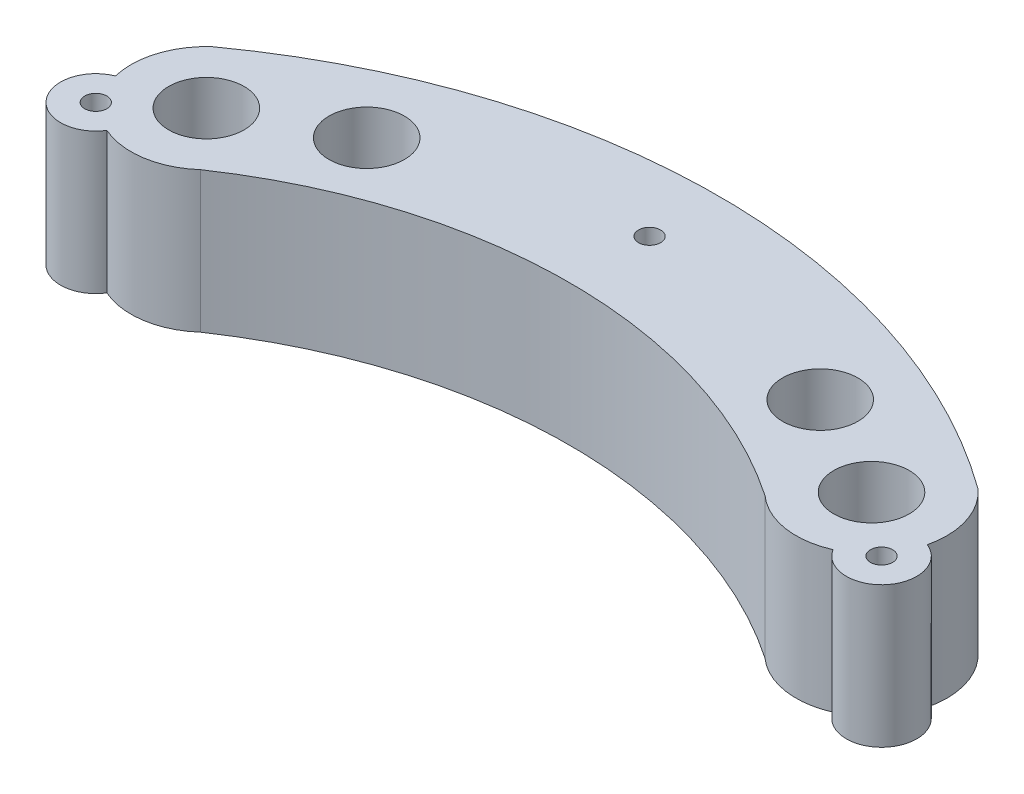
ISO-10303-21;
HEADER;
FILE_DESCRIPTION(('STEP AP214'),'2;1');
FILE_NAME('part.step','',(''),(''),'','','');
FILE_SCHEMA(('AUTOMOTIVE_DESIGN { 1 0 10303 214 1 1 1 1 }'));
ENDSEC;
DATA;
#1=APPLICATION_CONTEXT('core data for automotive mechanical design processes');
#2=APPLICATION_PROTOCOL_DEFINITION('international standard','automotive_design',2000,#1);
#3=PRODUCT_CONTEXT('',#1,'mechanical');
#4=PRODUCT('Part','Part','',(#3));
#5=PRODUCT_RELATED_PRODUCT_CATEGORY('part','',(#4));
#6=PRODUCT_DEFINITION_FORMATION('','',#4);
#7=PRODUCT_DEFINITION_CONTEXT('part definition',#1,'design');
#8=PRODUCT_DEFINITION('design','',#6,#7);
#9=PRODUCT_DEFINITION_SHAPE('','',#8);
#10=(LENGTH_UNIT() NAMED_UNIT(*) SI_UNIT(.MILLI.,.METRE.));
#11=(NAMED_UNIT(*) PLANE_ANGLE_UNIT() SI_UNIT($,.RADIAN.));
#12=(NAMED_UNIT(*) SI_UNIT($,.STERADIAN.) SOLID_ANGLE_UNIT());
#13=UNCERTAINTY_MEASURE_WITH_UNIT(LENGTH_MEASURE(1.E-05),#10,'distance_accuracy_value','');
#14=(GEOMETRIC_REPRESENTATION_CONTEXT(3) GLOBAL_UNCERTAINTY_ASSIGNED_CONTEXT((#13)) GLOBAL_UNIT_ASSIGNED_CONTEXT((#10,
#11,#12)) REPRESENTATION_CONTEXT('',''));
#15=CARTESIAN_POINT('',(0.,0.,0.));
#16=DIRECTION('',(0.,0.,1.));
#17=DIRECTION('',(1.,0.,0.));
#18=AXIS2_PLACEMENT_3D('',#15,#16,#17);
#19=CARTESIAN_POINT('',(84.0143896078789,-3.175,0.));
#20=DIRECTION('',(0.,1.,0.));
#21=DIRECTION('',(0.,0.,1.));
#22=AXIS2_PLACEMENT_3D('',#19,#20,#21);
#23=CYLINDRICAL_SURFACE('',#22,9.52500000000001);
#24=DIRECTION('',(0.,1.,0.));
#25=VECTOR('',#24,1.);
#26=CARTESIAN_POINT('',(93.2771410737958,5.715,2.21969824089963));
#27=LINE('',#26,#25);
#28=CARTESIAN_POINT('',(93.2771410737958,-3.175,2.21969824089963));
#29=VERTEX_POINT('',#28);
#30=CARTESIAN_POINT('',(93.2771410737958,14.605,2.21969824089963));
#31=VERTEX_POINT('',#30);
#32=EDGE_CURVE('E102',#29,#31,#27,.T.);
#33=ORIENTED_EDGE('',*,*,#32,.F.);
#34=CARTESIAN_POINT('',(84.0143896078789,-3.175,0.));
#35=DIRECTION('',(0.,1.,0.));
#36=DIRECTION('',(0.,0.,1.));
#37=AXIS2_PLACEMENT_3D('',#34,#35,#36);
#38=CIRCLE('',#37,9.52500000000001);
#39=CARTESIAN_POINT('',(90.364389607879,-3.175,-7.09951582856176));
#40=VERTEX_POINT('',#39);
#41=EDGE_CURVE('E112',#29,#40,#38,.T.);
#42=ORIENTED_EDGE('',*,*,#41,.T.);
#43=DIRECTION('',(0.,1.,0.));
#44=VECTOR('',#43,1.);
#45=CARTESIAN_POINT('',(90.364389607879,-3.175,-7.09951582856176));
#46=LINE('',#45,#44);
#47=CARTESIAN_POINT('',(90.364389607879,14.605,-7.09951582856176));
#48=VERTEX_POINT('',#47);
#49=EDGE_CURVE('E11',#40,#48,#46,.T.);
#50=ORIENTED_EDGE('',*,*,#49,.T.);
#51=CARTESIAN_POINT('',(84.0143896078789,14.605,0.));
#52=DIRECTION('',(0.,1.,0.));
#53=DIRECTION('',(0.,0.,1.));
#54=AXIS2_PLACEMENT_3D('',#51,#52,#53);
#55=CIRCLE('',#54,9.52500000000001);
#56=EDGE_CURVE('E114',#31,#48,#55,.T.);
#57=ORIENTED_EDGE('',*,*,#56,.F.);
#58=EDGE_LOOP('',(#33,#42,#50,#57));
#59=FACE_BOUND('',#58,.T.);
#60=ADVANCED_FACE('F34',(#59),#23,.T.);
#61=CARTESIAN_POINT('',(0.,-3.175,0.));
#62=DIRECTION('',(0.,1.,0.));
#63=DIRECTION('',(0.,0.,1.));
#64=AXIS2_PLACEMENT_3D('',#61,#62,#63);
#65=CYLINDRICAL_SURFACE('',#64,9.525);
#66=DIRECTION('',(0.,1.,0.));
#67=VECTOR('',#66,1.);
#68=CARTESIAN_POINT('',(-3.85364197670597,5.715,8.71062962795283));
#69=LINE('',#68,#67);
#70=CARTESIAN_POINT('',(-3.85364197670597,-3.175,8.71062962795283));
#71=VERTEX_POINT('',#70);
#72=CARTESIAN_POINT('',(-3.85364197670597,14.605,8.71062962795283));
#73=VERTEX_POINT('',#72);
#74=EDGE_CURVE('E194',#71,#73,#69,.T.);
#75=ORIENTED_EDGE('',*,*,#74,.F.);
#76=CARTESIAN_POINT('',(0.,-3.175,0.));
#77=DIRECTION('',(0.,1.,0.));
#78=DIRECTION('',(0.,0.,1.));
#79=AXIS2_PLACEMENT_3D('',#76,#77,#78);
#80=CIRCLE('',#79,9.525);
#81=CARTESIAN_POINT('',(6.35,-3.175,7.09951582856184));
#82=VERTEX_POINT('',#81);
#83=EDGE_CURVE('E183',#71,#82,#80,.T.);
#84=ORIENTED_EDGE('',*,*,#83,.T.);
#85=DIRECTION('',(0.,1.,0.));
#86=VECTOR('',#85,1.);
#87=CARTESIAN_POINT('',(6.35,-3.175,7.09951582856184));
#88=LINE('',#87,#86);
#89=CARTESIAN_POINT('',(6.35,14.605,7.09951582856184));
#90=VERTEX_POINT('',#89);
#91=EDGE_CURVE('E131',#82,#90,#88,.T.);
#92=ORIENTED_EDGE('',*,*,#91,.T.);
#93=CARTESIAN_POINT('',(0.,14.605,0.));
#94=DIRECTION('',(0.,1.,0.));
#95=DIRECTION('',(0.,0.,1.));
#96=AXIS2_PLACEMENT_3D('',#93,#94,#95);
#97=CIRCLE('',#96,9.525);
#98=EDGE_CURVE('E175',#73,#90,#97,.T.);
#99=ORIENTED_EDGE('',*,*,#98,.F.);
#100=EDGE_LOOP('',(#75,#84,#92,#99));
#101=FACE_BOUND('',#100,.T.);
#102=ADVANCED_FACE('F191',(#101),#65,.T.);
#103=CARTESIAN_POINT('',(42.0071948039394,-3.175,59.8040282531522));
#104=DIRECTION('',(0.,1.,0.));
#105=DIRECTION('',(0.,0.,1.));
#106=AXIS2_PLACEMENT_3D('',#103,#104,#105);
#107=CYLINDRICAL_SURFACE('',#106,82.55);
#108=DIRECTION('',(0.,1.,0.));
#109=VECTOR('',#108,1.);
#110=CARTESIAN_POINT('',(-6.35000000000005,-3.175,-7.09951582856179));
#111=LINE('',#110,#109);
#112=CARTESIAN_POINT('',(-6.35000000000005,-3.175,-7.09951582856179));
#113=VERTEX_POINT('',#112);
#114=CARTESIAN_POINT('',(-6.35000000000005,14.605,-7.09951582856179));
#115=VERTEX_POINT('',#114);
#116=EDGE_CURVE('E124',#113,#115,#111,.T.);
#117=ORIENTED_EDGE('',*,*,#116,.T.);
#118=CARTESIAN_POINT('',(42.0071948039394,14.605,59.8040282531522));
#119=DIRECTION('',(0.,1.,0.));
#120=DIRECTION('',(0.,0.,1.));
#121=AXIS2_PLACEMENT_3D('',#118,#119,#120);
#122=CIRCLE('',#121,82.55);
#123=EDGE_CURVE('E148',#115,#48,#122,.F.);
#124=ORIENTED_EDGE('',*,*,#123,.T.);
#125=ORIENTED_EDGE('',*,*,#49,.F.);
#126=CARTESIAN_POINT('',(42.0071948039394,-3.175,59.8040282531522));
#127=DIRECTION('',(0.,1.,0.));
#128=DIRECTION('',(0.,0.,1.));
#129=AXIS2_PLACEMENT_3D('',#126,#127,#128);
#130=CIRCLE('',#129,82.55);
#131=EDGE_CURVE('E119',#113,#40,#130,.F.);
#132=ORIENTED_EDGE('',*,*,#131,.F.);
#133=EDGE_LOOP('',(#117,#124,#125,#132));
#134=FACE_BOUND('',#133,.T.);
#135=ADVANCED_FACE('F36',(#134),#107,.T.);
#136=DIRECTION('',(0.,1.,0.));
#137=VECTOR('',#136,1.);
#138=CARTESIAN_POINT('',(87.8680315845849,5.715,8.71062962795284));
#139=LINE('',#138,#137);
#140=CARTESIAN_POINT('',(87.8680315845849,14.605,8.71062962795284));
#141=VERTEX_POINT('',#140);
#142=CARTESIAN_POINT('',(87.8680315845849,-3.175,8.71062962795284));
#143=VERTEX_POINT('',#142);
#144=EDGE_CURVE('E105',#141,#143,#139,.F.);
#145=ORIENTED_EDGE('',*,*,#144,.F.);
#146=CARTESIAN_POINT('',(77.6643896078788,14.605,7.09951582856182));
#147=VERTEX_POINT('',#146);
#148=EDGE_CURVE('E181',#147,#141,#55,.T.);
#149=ORIENTED_EDGE('',*,*,#148,.F.);
#150=DIRECTION('',(0.,1.,0.));
#151=VECTOR('',#150,1.);
#152=CARTESIAN_POINT('',(77.6643896078788,-3.175,7.09951582856182));
#153=LINE('',#152,#151);
#154=CARTESIAN_POINT('',(77.6643896078788,-3.175,7.09951582856182));
#155=VERTEX_POINT('',#154);
#156=EDGE_CURVE('E43',#155,#147,#153,.T.);
#157=ORIENTED_EDGE('',*,*,#156,.F.);
#158=EDGE_CURVE('E121',#155,#143,#38,.T.);
#159=ORIENTED_EDGE('',*,*,#158,.T.);
#160=EDGE_LOOP('',(#145,#149,#157,#159));
#161=FACE_BOUND('',#160,.T.);
#162=ADVANCED_FACE('F200',(#161),#23,.T.);
#163=CARTESIAN_POINT('',(42.0071948039394,-3.175,59.642968881382));
#164=DIRECTION('',(0.,1.,0.));
#165=DIRECTION('',(0.,0.,1.));
#166=AXIS2_PLACEMENT_3D('',#163,#164,#165);
#167=CYLINDRICAL_SURFACE('',#166,63.5);
#168=ORIENTED_EDGE('',*,*,#156,.T.);
#169=CARTESIAN_POINT('',(42.0071948039394,14.605,59.642968881382));
#170=DIRECTION('',(0.,1.,0.));
#171=DIRECTION('',(0.,0.,1.));
#172=AXIS2_PLACEMENT_3D('',#169,#170,#171);
#173=CIRCLE('',#172,63.5);
#174=EDGE_CURVE('E178',#90,#147,#173,.F.);
#175=ORIENTED_EDGE('',*,*,#174,.F.);
#176=ORIENTED_EDGE('',*,*,#91,.F.);
#177=CARTESIAN_POINT('',(42.0071948039394,-3.175,59.642968881382));
#178=DIRECTION('',(0.,1.,0.));
#179=DIRECTION('',(0.,0.,1.));
#180=AXIS2_PLACEMENT_3D('',#177,#178,#179);
#181=CIRCLE('',#180,63.5);
#182=EDGE_CURVE('E122',#82,#155,#181,.F.);
#183=ORIENTED_EDGE('',*,*,#182,.T.);
#184=EDGE_LOOP('',(#168,#175,#176,#183));
#185=FACE_BOUND('',#184,.T.);
#186=ADVANCED_FACE('F198',(#185),#167,.F.);
#187=DIRECTION('',(0.,1.,0.));
#188=VECTOR('',#187,1.);
#189=CARTESIAN_POINT('',(-9.26275146591698,5.715,2.21969824089963));
#190=LINE('',#189,#188);
#191=CARTESIAN_POINT('',(-9.26275146591698,14.605,2.21969824089963));
#192=VERTEX_POINT('',#191);
#193=CARTESIAN_POINT('',(-9.26275146591698,-3.175,2.21969824089963));
#194=VERTEX_POINT('',#193);
#195=EDGE_CURVE('E244',#192,#194,#190,.F.);
#196=ORIENTED_EDGE('',*,*,#195,.F.);
#197=EDGE_CURVE('E176',#115,#192,#97,.T.);
#198=ORIENTED_EDGE('',*,*,#197,.F.);
#199=ORIENTED_EDGE('',*,*,#116,.F.);
#200=EDGE_CURVE('E126',#113,#194,#80,.T.);
#201=ORIENTED_EDGE('',*,*,#200,.T.);
#202=EDGE_LOOP('',(#196,#198,#199,#201));
#203=FACE_BOUND('',#202,.T.);
#204=ADVANCED_FACE('F231',(#203),#65,.T.);
#205=CARTESIAN_POINT('',(0.,-3.175,0.));
#206=DIRECTION('',(0.,1.,0.));
#207=DIRECTION('',(0.,0.,1.));
#208=AXIS2_PLACEMENT_3D('',#205,#206,#207);
#209=PLANE('',#208);
#210=CARTESIAN_POINT('',(42.0071948039394,-3.175,-13.97));
#211=DIRECTION('',(0.,1.,0.));
#212=DIRECTION('',(0.,0.,1.));
#213=AXIS2_PLACEMENT_3D('',#210,#211,#212);
#214=CIRCLE('',#213,1.397);
#215=CARTESIAN_POINT('',(42.0071948039394,-3.175,-12.573));
#216=VERTEX_POINT('',#215);
#217=EDGE_CURVE('E465',#216,#216,#214,.T.);
#218=ORIENTED_EDGE('',*,*,#217,.T.);
#219=EDGE_LOOP('',(#218));
#220=FACE_BOUND('',#219,.T.);
#221=CARTESIAN_POINT('',(-7.62,-3.175,6.35));
#222=DIRECTION('',(0.,1.,0.));
#223=DIRECTION('',(0.,0.,1.));
#224=AXIS2_PLACEMENT_3D('',#221,#222,#223);
#225=CIRCLE('',#224,1.397);
#226=CARTESIAN_POINT('',(-7.62,-3.175,7.747));
#227=VERTEX_POINT('',#226);
#228=EDGE_CURVE('E469',#227,#227,#225,.T.);
#229=ORIENTED_EDGE('',*,*,#228,.T.);
#230=EDGE_LOOP('',(#229));
#231=FACE_BOUND('',#230,.T.);
#232=CARTESIAN_POINT('',(91.6343896078789,-3.175,6.35));
#233=DIRECTION('',(0.,1.,0.));
#234=DIRECTION('',(0.,0.,1.));
#235=AXIS2_PLACEMENT_3D('',#232,#233,#234);
#236=CIRCLE('',#235,1.39699999999999);
#237=CARTESIAN_POINT('',(91.6343896078789,-3.175,7.74699999999999));
#238=VERTEX_POINT('',#237);
#239=EDGE_CURVE('E478',#238,#238,#236,.T.);
#240=ORIENTED_EDGE('',*,*,#239,.T.);
#241=EDGE_LOOP('',(#240));
#242=FACE_BOUND('',#241,.T.);
#243=CARTESIAN_POINT('',(84.0143896078789,-3.175,0.));
#244=DIRECTION('',(0.,1.,0.));
#245=DIRECTION('',(0.,0.,1.));
#246=AXIS2_PLACEMENT_3D('',#243,#244,#245);
#247=CIRCLE('',#246,2.2225);
#248=CARTESIAN_POINT('',(84.0143896078789,-3.175,2.2225));
#249=VERTEX_POINT('',#248);
#250=EDGE_CURVE('E38',#249,#249,#247,.T.);
#251=ORIENTED_EDGE('',*,*,#250,.T.);
#252=EDGE_LOOP('',(#251));
#253=FACE_BOUND('',#252,.T.);
#254=CARTESIAN_POINT('',(70.6469868316689,-3.175,-6.88606544106099));
#255=DIRECTION('',(0.,1.,0.));
#256=DIRECTION('',(0.,0.,1.));
#257=AXIS2_PLACEMENT_3D('',#254,#255,#256);
#258=CIRCLE('',#257,2.2225);
#259=CARTESIAN_POINT('',(70.6469868316689,-3.175,-4.66356544106099));
#260=VERTEX_POINT('',#259);
#261=EDGE_CURVE('E155',#260,#260,#258,.T.);
#262=ORIENTED_EDGE('',*,*,#261,.T.);
#263=EDGE_LOOP('',(#262));
#264=FACE_BOUND('',#263,.T.);
#265=CARTESIAN_POINT('',(0.,-3.175,0.));
#266=DIRECTION('',(0.,1.,0.));
#267=DIRECTION('',(0.,0.,1.));
#268=AXIS2_PLACEMENT_3D('',#265,#266,#267);
#269=CIRCLE('',#268,2.2225);
#270=CARTESIAN_POINT('',(0.,-3.175,2.2225));
#271=VERTEX_POINT('',#270);
#272=EDGE_CURVE('E152',#271,#271,#269,.T.);
#273=ORIENTED_EDGE('',*,*,#272,.T.);
#274=EDGE_LOOP('',(#273));
#275=FACE_BOUND('',#274,.T.);
#276=CARTESIAN_POINT('',(13.36740277621,-3.175,-6.88606544106099));
#277=DIRECTION('',(0.,1.,0.));
#278=DIRECTION('',(0.,0.,1.));
#279=AXIS2_PLACEMENT_3D('',#276,#277,#278);
#280=CIRCLE('',#279,2.2225);
#281=CARTESIAN_POINT('',(13.36740277621,-3.175,-4.66356544106099));
#282=VERTEX_POINT('',#281);
#283=EDGE_CURVE('E149',#282,#282,#280,.T.);
#284=ORIENTED_EDGE('',*,*,#283,.T.);
#285=EDGE_LOOP('',(#284));
#286=FACE_BOUND('',#285,.T.);
#287=ORIENTED_EDGE('',*,*,#41,.F.);
#288=CARTESIAN_POINT('',(91.6343896078789,-3.175,6.35));
#289=DIRECTION('',(0.,1.,0.));
#290=DIRECTION('',(0.,0.,1.));
#291=AXIS2_PLACEMENT_3D('',#288,#289,#290);
#292=CIRCLE('',#291,4.445);
#293=EDGE_CURVE('E99',#143,#29,#292,.T.);
#294=ORIENTED_EDGE('',*,*,#293,.F.);
#295=ORIENTED_EDGE('',*,*,#158,.F.);
#296=ORIENTED_EDGE('',*,*,#182,.F.);
#297=ORIENTED_EDGE('',*,*,#83,.F.);
#298=CARTESIAN_POINT('',(-7.62,-3.175,6.35));
#299=DIRECTION('',(0.,1.,0.));
#300=DIRECTION('',(0.,0.,1.));
#301=AXIS2_PLACEMENT_3D('',#298,#299,#300);
#302=CIRCLE('',#301,4.445);
#303=EDGE_CURVE('E246',#194,#71,#302,.T.);
#304=ORIENTED_EDGE('',*,*,#303,.F.);
#305=ORIENTED_EDGE('',*,*,#200,.F.);
#306=ORIENTED_EDGE('',*,*,#131,.T.);
#307=EDGE_LOOP('',(#287,#294,#295,#296,#297,#304,#305,#306));
#308=FACE_BOUND('',#307,.T.);
#309=ADVANCED_FACE('F116',(#220,#231,#242,#253,#264,#275,#286,#308),#209,.F.);
#310=CARTESIAN_POINT('',(0.,14.605,0.));
#311=DIRECTION('',(0.,1.,0.));
#312=DIRECTION('',(0.,0.,1.));
#313=AXIS2_PLACEMENT_3D('',#310,#311,#312);
#314=PLANE('',#313);
#315=CARTESIAN_POINT('',(42.0071948039394,14.605,-13.97));
#316=DIRECTION('',(0.,1.,0.));
#317=DIRECTION('',(0.,0.,1.));
#318=AXIS2_PLACEMENT_3D('',#315,#316,#317);
#319=CIRCLE('',#318,1.397);
#320=CARTESIAN_POINT('',(42.0071948039394,14.605,-12.573));
#321=VERTEX_POINT('',#320);
#322=EDGE_CURVE('E468',#321,#321,#319,.T.);
#323=ORIENTED_EDGE('',*,*,#322,.F.);
#324=EDGE_LOOP('',(#323));
#325=FACE_BOUND('',#324,.T.);
#326=CARTESIAN_POINT('',(-7.62,14.605,6.35));
#327=DIRECTION('',(0.,1.,0.));
#328=DIRECTION('',(0.,0.,1.));
#329=AXIS2_PLACEMENT_3D('',#326,#327,#328);
#330=CIRCLE('',#329,1.397);
#331=CARTESIAN_POINT('',(-7.62,14.605,7.747));
#332=VERTEX_POINT('',#331);
#333=EDGE_CURVE('E473',#332,#332,#330,.T.);
#334=ORIENTED_EDGE('',*,*,#333,.F.);
#335=EDGE_LOOP('',(#334));
#336=FACE_BOUND('',#335,.T.);
#337=CARTESIAN_POINT('',(91.6343896078789,14.605,6.35));
#338=DIRECTION('',(0.,1.,0.));
#339=DIRECTION('',(0.,0.,1.));
#340=AXIS2_PLACEMENT_3D('',#337,#338,#339);
#341=CIRCLE('',#340,1.39699999999999);
#342=CARTESIAN_POINT('',(91.6343896078789,14.605,7.74699999999999));
#343=VERTEX_POINT('',#342);
#344=EDGE_CURVE('E481',#343,#343,#341,.T.);
#345=ORIENTED_EDGE('',*,*,#344,.F.);
#346=EDGE_LOOP('',(#345));
#347=FACE_BOUND('',#346,.T.);
#348=ORIENTED_EDGE('',*,*,#148,.T.);
#349=CARTESIAN_POINT('',(91.6343896078789,14.605,6.35));
#350=DIRECTION('',(0.,1.,0.));
#351=DIRECTION('',(0.,0.,1.));
#352=AXIS2_PLACEMENT_3D('',#349,#350,#351);
#353=CIRCLE('',#352,4.445);
#354=EDGE_CURVE('E51',#141,#31,#353,.T.);
#355=ORIENTED_EDGE('',*,*,#354,.T.);
#356=ORIENTED_EDGE('',*,*,#56,.T.);
#357=ORIENTED_EDGE('',*,*,#123,.F.);
#358=ORIENTED_EDGE('',*,*,#197,.T.);
#359=CARTESIAN_POINT('',(-7.62,14.605,6.35));
#360=DIRECTION('',(0.,1.,0.));
#361=DIRECTION('',(0.,0.,1.));
#362=AXIS2_PLACEMENT_3D('',#359,#360,#361);
#363=CIRCLE('',#362,4.445);
#364=EDGE_CURVE('E58',#192,#73,#363,.T.);
#365=ORIENTED_EDGE('',*,*,#364,.T.);
#366=ORIENTED_EDGE('',*,*,#98,.T.);
#367=ORIENTED_EDGE('',*,*,#174,.T.);
#368=EDGE_LOOP('',(#348,#355,#356,#357,#358,#365,#366,#367));
#369=FACE_BOUND('',#368,.T.);
#370=CARTESIAN_POINT('',(0.,14.605,0.));
#371=DIRECTION('',(0.,1.,0.));
#372=DIRECTION('',(0.,0.,1.));
#373=AXIS2_PLACEMENT_3D('',#370,#371,#372);
#374=CIRCLE('',#373,4.7625);
#375=CARTESIAN_POINT('',(0.,14.605,4.7625));
#376=VERTEX_POINT('',#375);
#377=EDGE_CURVE('E145',#376,#376,#374,.F.);
#378=ORIENTED_EDGE('',*,*,#377,.T.);
#379=EDGE_LOOP('',(#378));
#380=FACE_BOUND('',#379,.T.);
#381=CARTESIAN_POINT('',(13.36740277621,14.605,-6.88606544106099));
#382=DIRECTION('',(0.,1.,0.));
#383=DIRECTION('',(0.,0.,1.));
#384=AXIS2_PLACEMENT_3D('',#381,#382,#383);
#385=CIRCLE('',#384,4.7625);
#386=CARTESIAN_POINT('',(13.36740277621,14.605,-2.12356544106099));
#387=VERTEX_POINT('',#386);
#388=EDGE_CURVE('E142',#387,#387,#385,.F.);
#389=ORIENTED_EDGE('',*,*,#388,.T.);
#390=EDGE_LOOP('',(#389));
#391=FACE_BOUND('',#390,.T.);
#392=CARTESIAN_POINT('',(70.6469868316689,14.605,-6.88606544106099));
#393=DIRECTION('',(0.,1.,0.));
#394=DIRECTION('',(0.,0.,1.));
#395=AXIS2_PLACEMENT_3D('',#392,#393,#394);
#396=CIRCLE('',#395,4.7625);
#397=CARTESIAN_POINT('',(70.6469868316689,14.605,-2.12356544106099));
#398=VERTEX_POINT('',#397);
#399=EDGE_CURVE('E138',#398,#398,#396,.F.);
#400=ORIENTED_EDGE('',*,*,#399,.T.);
#401=EDGE_LOOP('',(#400));
#402=FACE_BOUND('',#401,.T.);
#403=CARTESIAN_POINT('',(84.0143896078789,14.605,0.));
#404=DIRECTION('',(0.,1.,0.));
#405=DIRECTION('',(0.,0.,1.));
#406=AXIS2_PLACEMENT_3D('',#403,#404,#405);
#407=CIRCLE('',#406,4.7625);
#408=CARTESIAN_POINT('',(84.0143896078789,14.605,4.7625));
#409=VERTEX_POINT('',#408);
#410=EDGE_CURVE('E135',#409,#409,#407,.F.);
#411=ORIENTED_EDGE('',*,*,#410,.T.);
#412=EDGE_LOOP('',(#411));
#413=FACE_BOUND('',#412,.T.);
#414=ADVANCED_FACE('F202',(#325,#336,#347,#369,#380,#391,#402,#413),#314,.T.);
#415=CARTESIAN_POINT('',(84.0143896078789,20.32,0.));
#416=DIRECTION('',(0.,-1.,0.));
#417=DIRECTION('',(0.,0.,-1.));
#418=AXIS2_PLACEMENT_3D('',#415,#416,#417);
#419=CYLINDRICAL_SURFACE('',#418,4.7625);
#420=ORIENTED_EDGE('',*,*,#410,.F.);
#421=EDGE_LOOP('',(#420));
#422=FACE_BOUND('',#421,.T.);
#423=CARTESIAN_POINT('',(84.0143896078789,0.,0.));
#424=DIRECTION('',(0.,1.,0.));
#425=DIRECTION('',(0.,0.,1.));
#426=AXIS2_PLACEMENT_3D('',#423,#424,#425);
#427=CIRCLE('',#426,4.7625);
#428=CARTESIAN_POINT('',(84.0143896078789,0.,4.7625));
#429=VERTEX_POINT('',#428);
#430=EDGE_CURVE('E160',#429,#429,#427,.T.);
#431=ORIENTED_EDGE('',*,*,#430,.F.);
#432=EDGE_LOOP('',(#431));
#433=FACE_BOUND('',#432,.T.);
#434=ADVANCED_FACE('F205',(#422,#433),#419,.F.);
#435=CARTESIAN_POINT('',(84.0143896078789,0.,0.));
#436=DIRECTION('',(0.,1.,0.));
#437=DIRECTION('',(0.,0.,1.));
#438=AXIS2_PLACEMENT_3D('',#435,#436,#437);
#439=PLANE('',#438);
#440=CARTESIAN_POINT('',(84.0143896078789,0.,0.));
#441=DIRECTION('',(0.,1.,0.));
#442=DIRECTION('',(0.,0.,1.));
#443=AXIS2_PLACEMENT_3D('',#440,#441,#442);
#444=CIRCLE('',#443,2.2225);
#445=CARTESIAN_POINT('',(84.0143896078789,0.,2.2225));
#446=VERTEX_POINT('',#445);
#447=EDGE_CURVE('E248',#446,#446,#444,.T.);
#448=ORIENTED_EDGE('',*,*,#447,.F.);
#449=EDGE_LOOP('',(#448));
#450=FACE_BOUND('',#449,.T.);
#451=ORIENTED_EDGE('',*,*,#430,.T.);
#452=EDGE_LOOP('',(#451));
#453=FACE_BOUND('',#452,.T.);
#454=ADVANCED_FACE('F218',(#450,#453),#439,.T.);
#455=CARTESIAN_POINT('',(70.6469868316689,20.32,-6.88606544106099));
#456=DIRECTION('',(0.,-1.,0.));
#457=DIRECTION('',(0.,0.,-1.));
#458=AXIS2_PLACEMENT_3D('',#455,#456,#457);
#459=CYLINDRICAL_SURFACE('',#458,4.7625);
#460=ORIENTED_EDGE('',*,*,#399,.F.);
#461=EDGE_LOOP('',(#460));
#462=FACE_BOUND('',#461,.T.);
#463=CARTESIAN_POINT('',(70.6469868316689,0.,-6.88606544106099));
#464=DIRECTION('',(0.,1.,0.));
#465=DIRECTION('',(0.,0.,1.));
#466=AXIS2_PLACEMENT_3D('',#463,#464,#465);
#467=CIRCLE('',#466,4.7625);
#468=CARTESIAN_POINT('',(70.6469868316689,0.,-2.12356544106099));
#469=VERTEX_POINT('',#468);
#470=EDGE_CURVE('E164',#469,#469,#467,.T.);
#471=ORIENTED_EDGE('',*,*,#470,.F.);
#472=EDGE_LOOP('',(#471));
#473=FACE_BOUND('',#472,.T.);
#474=ADVANCED_FACE('F223',(#462,#473),#459,.F.);
#475=CARTESIAN_POINT('',(70.6469868316689,0.,-6.88606544106099));
#476=DIRECTION('',(0.,1.,0.));
#477=DIRECTION('',(0.,0.,1.));
#478=AXIS2_PLACEMENT_3D('',#475,#476,#477);
#479=PLANE('',#478);
#480=CARTESIAN_POINT('',(70.6469868316689,0.,-6.88606544106099));
#481=DIRECTION('',(0.,1.,0.));
#482=DIRECTION('',(0.,0.,1.));
#483=AXIS2_PLACEMENT_3D('',#480,#481,#482);
#484=CIRCLE('',#483,2.2225);
#485=CARTESIAN_POINT('',(70.6469868316689,0.,-4.66356544106099));
#486=VERTEX_POINT('',#485);
#487=EDGE_CURVE('E256',#486,#486,#484,.T.);
#488=ORIENTED_EDGE('',*,*,#487,.F.);
#489=EDGE_LOOP('',(#488));
#490=FACE_BOUND('',#489,.T.);
#491=ORIENTED_EDGE('',*,*,#470,.T.);
#492=EDGE_LOOP('',(#491));
#493=FACE_BOUND('',#492,.T.);
#494=ADVANCED_FACE('F271',(#490,#493),#479,.T.);
#495=CARTESIAN_POINT('',(13.36740277621,20.32,-6.88606544106099));
#496=DIRECTION('',(0.,-1.,0.));
#497=DIRECTION('',(0.,0.,-1.));
#498=AXIS2_PLACEMENT_3D('',#495,#496,#497);
#499=CYLINDRICAL_SURFACE('',#498,4.7625);
#500=ORIENTED_EDGE('',*,*,#388,.F.);
#501=EDGE_LOOP('',(#500));
#502=FACE_BOUND('',#501,.T.);
#503=CARTESIAN_POINT('',(13.36740277621,0.,-6.88606544106099));
#504=DIRECTION('',(0.,1.,0.));
#505=DIRECTION('',(0.,0.,1.));
#506=AXIS2_PLACEMENT_3D('',#503,#504,#505);
#507=CIRCLE('',#506,4.7625);
#508=CARTESIAN_POINT('',(13.36740277621,0.,-2.12356544106099));
#509=VERTEX_POINT('',#508);
#510=EDGE_CURVE('E169',#509,#509,#507,.T.);
#511=ORIENTED_EDGE('',*,*,#510,.F.);
#512=EDGE_LOOP('',(#511));
#513=FACE_BOUND('',#512,.T.);
#514=ADVANCED_FACE('F269',(#502,#513),#499,.F.);
#515=CARTESIAN_POINT('',(13.36740277621,0.,-6.88606544106099));
#516=DIRECTION('',(0.,1.,0.));
#517=DIRECTION('',(0.,0.,1.));
#518=AXIS2_PLACEMENT_3D('',#515,#516,#517);
#519=PLANE('',#518);
#520=CARTESIAN_POINT('',(13.36740277621,0.,-6.88606544106099));
#521=DIRECTION('',(0.,1.,0.));
#522=DIRECTION('',(0.,0.,1.));
#523=AXIS2_PLACEMENT_3D('',#520,#521,#522);
#524=CIRCLE('',#523,2.2225);
#525=CARTESIAN_POINT('',(13.36740277621,0.,-4.66356544106099));
#526=VERTEX_POINT('',#525);
#527=EDGE_CURVE('E153',#526,#526,#524,.T.);
#528=ORIENTED_EDGE('',*,*,#527,.F.);
#529=EDGE_LOOP('',(#528));
#530=FACE_BOUND('',#529,.T.);
#531=ORIENTED_EDGE('',*,*,#510,.T.);
#532=EDGE_LOOP('',(#531));
#533=FACE_BOUND('',#532,.T.);
#534=ADVANCED_FACE('F267',(#530,#533),#519,.T.);
#535=CARTESIAN_POINT('',(0.,20.32,0.));
#536=DIRECTION('',(0.,-1.,0.));
#537=DIRECTION('',(0.,0.,-1.));
#538=AXIS2_PLACEMENT_3D('',#535,#536,#537);
#539=CYLINDRICAL_SURFACE('',#538,4.7625);
#540=ORIENTED_EDGE('',*,*,#377,.F.);
#541=EDGE_LOOP('',(#540));
#542=FACE_BOUND('',#541,.T.);
#543=CARTESIAN_POINT('',(0.,0.,0.));
#544=DIRECTION('',(0.,1.,0.));
#545=DIRECTION('',(0.,0.,1.));
#546=AXIS2_PLACEMENT_3D('',#543,#544,#545);
#547=CIRCLE('',#546,4.7625);
#548=CARTESIAN_POINT('',(0.,0.,4.7625));
#549=VERTEX_POINT('',#548);
#550=EDGE_CURVE('E139',#549,#549,#547,.T.);
#551=ORIENTED_EDGE('',*,*,#550,.F.);
#552=EDGE_LOOP('',(#551));
#553=FACE_BOUND('',#552,.T.);
#554=ADVANCED_FACE('F278',(#542,#553),#539,.F.);
#555=CARTESIAN_POINT('',(0.,0.,0.));
#556=DIRECTION('',(0.,1.,0.));
#557=DIRECTION('',(0.,0.,1.));
#558=AXIS2_PLACEMENT_3D('',#555,#556,#557);
#559=PLANE('',#558);
#560=CARTESIAN_POINT('',(0.,0.,0.));
#561=DIRECTION('',(0.,1.,0.));
#562=DIRECTION('',(0.,0.,1.));
#563=AXIS2_PLACEMENT_3D('',#560,#561,#562);
#564=CIRCLE('',#563,2.2225);
#565=CARTESIAN_POINT('',(0.,0.,2.2225));
#566=VERTEX_POINT('',#565);
#567=EDGE_CURVE('E253',#566,#566,#564,.T.);
#568=ORIENTED_EDGE('',*,*,#567,.F.);
#569=EDGE_LOOP('',(#568));
#570=FACE_BOUND('',#569,.T.);
#571=ORIENTED_EDGE('',*,*,#550,.T.);
#572=EDGE_LOOP('',(#571));
#573=FACE_BOUND('',#572,.T.);
#574=ADVANCED_FACE('F315',(#570,#573),#559,.T.);
#575=CARTESIAN_POINT('',(13.36740277621,-20.32,-6.88606544106099));
#576=DIRECTION('',(0.,1.,0.));
#577=DIRECTION('',(0.,0.,1.));
#578=AXIS2_PLACEMENT_3D('',#575,#576,#577);
#579=CYLINDRICAL_SURFACE('',#578,2.2225);
#580=ORIENTED_EDGE('',*,*,#527,.T.);
#581=EDGE_LOOP('',(#580));
#582=FACE_BOUND('',#581,.T.);
#583=ORIENTED_EDGE('',*,*,#283,.F.);
#584=EDGE_LOOP('',(#583));
#585=FACE_BOUND('',#584,.T.);
#586=ADVANCED_FACE('F320',(#582,#585),#579,.F.);
#587=CARTESIAN_POINT('',(0.,-20.32,0.));
#588=DIRECTION('',(0.,1.,0.));
#589=DIRECTION('',(0.,0.,1.));
#590=AXIS2_PLACEMENT_3D('',#587,#588,#589);
#591=CYLINDRICAL_SURFACE('',#590,2.2225);
#592=ORIENTED_EDGE('',*,*,#567,.T.);
#593=EDGE_LOOP('',(#592));
#594=FACE_BOUND('',#593,.T.);
#595=ORIENTED_EDGE('',*,*,#272,.F.);
#596=EDGE_LOOP('',(#595));
#597=FACE_BOUND('',#596,.T.);
#598=ADVANCED_FACE('F330',(#594,#597),#591,.F.);
#599=CARTESIAN_POINT('',(70.6469868316689,-20.32,-6.88606544106099));
#600=DIRECTION('',(0.,1.,0.));
#601=DIRECTION('',(0.,0.,1.));
#602=AXIS2_PLACEMENT_3D('',#599,#600,#601);
#603=CYLINDRICAL_SURFACE('',#602,2.2225);
#604=ORIENTED_EDGE('',*,*,#487,.T.);
#605=EDGE_LOOP('',(#604));
#606=FACE_BOUND('',#605,.T.);
#607=ORIENTED_EDGE('',*,*,#261,.F.);
#608=EDGE_LOOP('',(#607));
#609=FACE_BOUND('',#608,.T.);
#610=ADVANCED_FACE('F340',(#606,#609),#603,.F.);
#611=CARTESIAN_POINT('',(84.0143896078789,-20.32,0.));
#612=DIRECTION('',(0.,1.,0.));
#613=DIRECTION('',(0.,0.,1.));
#614=AXIS2_PLACEMENT_3D('',#611,#612,#613);
#615=CYLINDRICAL_SURFACE('',#614,2.2225);
#616=ORIENTED_EDGE('',*,*,#447,.T.);
#617=EDGE_LOOP('',(#616));
#618=FACE_BOUND('',#617,.T.);
#619=ORIENTED_EDGE('',*,*,#250,.F.);
#620=EDGE_LOOP('',(#619));
#621=FACE_BOUND('',#620,.T.);
#622=ADVANCED_FACE('F350',(#618,#621),#615,.F.);
#623=CARTESIAN_POINT('',(-7.62,-3.175,6.35));
#624=DIRECTION('',(0.,1.,0.));
#625=DIRECTION('',(0.,0.,1.));
#626=AXIS2_PLACEMENT_3D('',#623,#624,#625);
#627=CYLINDRICAL_SURFACE('',#626,4.445);
#628=ORIENTED_EDGE('',*,*,#303,.T.);
#629=ORIENTED_EDGE('',*,*,#74,.T.);
#630=ORIENTED_EDGE('',*,*,#364,.F.);
#631=ORIENTED_EDGE('',*,*,#195,.T.);
#632=EDGE_LOOP('',(#628,#629,#630,#631));
#633=FACE_BOUND('',#632,.T.);
#634=ADVANCED_FACE('F359',(#633),#627,.T.);
#635=CARTESIAN_POINT('',(91.6343896078789,-3.175,6.35));
#636=DIRECTION('',(0.,1.,0.));
#637=DIRECTION('',(0.,0.,1.));
#638=AXIS2_PLACEMENT_3D('',#635,#636,#637);
#639=CYLINDRICAL_SURFACE('',#638,4.445);
#640=ORIENTED_EDGE('',*,*,#293,.T.);
#641=ORIENTED_EDGE('',*,*,#32,.T.);
#642=ORIENTED_EDGE('',*,*,#354,.F.);
#643=ORIENTED_EDGE('',*,*,#144,.T.);
#644=EDGE_LOOP('',(#640,#641,#642,#643));
#645=FACE_BOUND('',#644,.T.);
#646=ADVANCED_FACE('F101',(#645),#639,.T.);
#647=CARTESIAN_POINT('',(91.6343896078789,-3.175,6.35));
#648=DIRECTION('',(0.,1.,0.));
#649=DIRECTION('',(0.,0.,1.));
#650=AXIS2_PLACEMENT_3D('',#647,#648,#649);
#651=CYLINDRICAL_SURFACE('',#650,1.39699999999999);
#652=ORIENTED_EDGE('',*,*,#239,.F.);
#653=EDGE_LOOP('',(#652));
#654=FACE_BOUND('',#653,.T.);
#655=ORIENTED_EDGE('',*,*,#344,.T.);
#656=EDGE_LOOP('',(#655));
#657=FACE_BOUND('',#656,.T.);
#658=ADVANCED_FACE('F405',(#654,#657),#651,.F.);
#659=CARTESIAN_POINT('',(-7.62,-3.175,6.35));
#660=DIRECTION('',(0.,1.,0.));
#661=DIRECTION('',(0.,0.,1.));
#662=AXIS2_PLACEMENT_3D('',#659,#660,#661);
#663=CYLINDRICAL_SURFACE('',#662,1.397);
#664=ORIENTED_EDGE('',*,*,#228,.F.);
#665=EDGE_LOOP('',(#664));
#666=FACE_BOUND('',#665,.T.);
#667=ORIENTED_EDGE('',*,*,#333,.T.);
#668=EDGE_LOOP('',(#667));
#669=FACE_BOUND('',#668,.T.);
#670=ADVANCED_FACE('F427',(#666,#669),#663,.F.);
#671=CARTESIAN_POINT('',(42.0071948039394,-3.175,-13.97));
#672=DIRECTION('',(0.,1.,0.));
#673=DIRECTION('',(0.,0.,1.));
#674=AXIS2_PLACEMENT_3D('',#671,#672,#673);
#675=CYLINDRICAL_SURFACE('',#674,1.397);
#676=ORIENTED_EDGE('',*,*,#217,.F.);
#677=EDGE_LOOP('',(#676));
#678=FACE_BOUND('',#677,.T.);
#679=ORIENTED_EDGE('',*,*,#322,.T.);
#680=EDGE_LOOP('',(#679));
#681=FACE_BOUND('',#680,.T.);
#682=ADVANCED_FACE('F437',(#678,#681),#675,.F.);
#683=CLOSED_SHELL('',(#60,#102,#135,#162,#186,#204,#309,#414,#434,#454,#474,#494,#514,#534,#554,
#574,#586,#598,#610,#622,#634,#646,#658,#670,#682));
#684=MANIFOLD_SOLID_BREP('B2',#683);
#685=ADVANCED_BREP_SHAPE_REPRESENTATION('',(#18,#684),#14);
#686=SHAPE_DEFINITION_REPRESENTATION(#9,#685);
ENDSEC;
END-ISO-10303-21;
